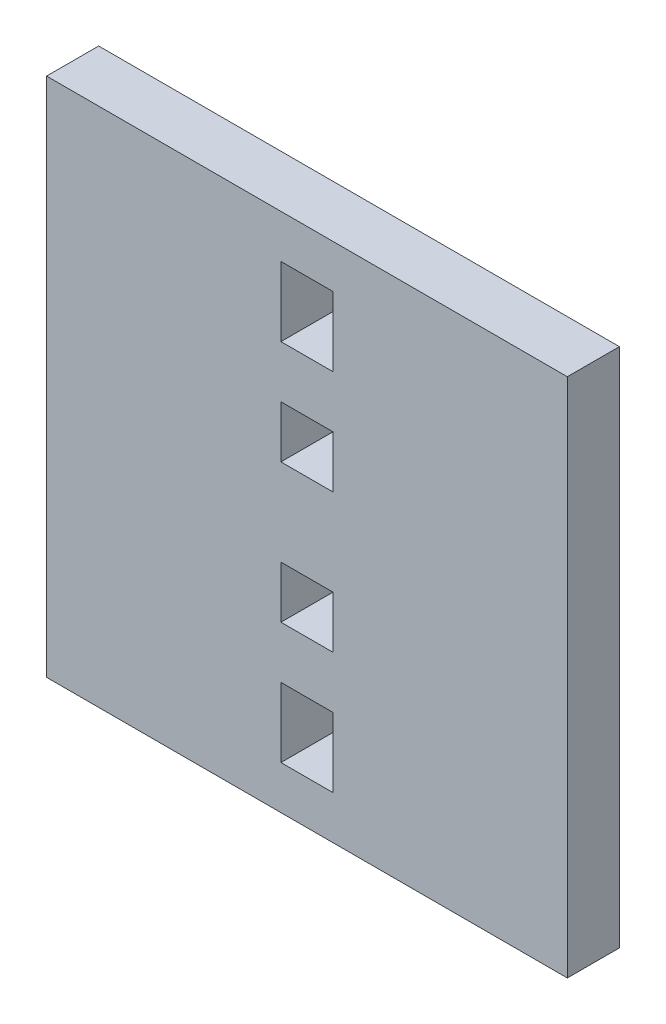
ISO-10303-21;
HEADER;
FILE_DESCRIPTION(('STEP AP214'),'2;1');
FILE_NAME('part.step','',(''),(''),'','','');
FILE_SCHEMA(('AUTOMOTIVE_DESIGN { 1 0 10303 214 1 1 1 1 }'));
ENDSEC;
DATA;
#1=APPLICATION_CONTEXT('core data for automotive mechanical design processes');
#2=APPLICATION_PROTOCOL_DEFINITION('international standard','automotive_design',2000,#1);
#3=PRODUCT_CONTEXT('',#1,'mechanical');
#4=PRODUCT('Part','Part','',(#3));
#5=PRODUCT_RELATED_PRODUCT_CATEGORY('part','',(#4));
#6=PRODUCT_DEFINITION_FORMATION('','',#4);
#7=PRODUCT_DEFINITION_CONTEXT('part definition',#1,'design');
#8=PRODUCT_DEFINITION('design','',#6,#7);
#9=PRODUCT_DEFINITION_SHAPE('','',#8);
#10=(LENGTH_UNIT() NAMED_UNIT(*) SI_UNIT(.MILLI.,.METRE.));
#11=(NAMED_UNIT(*) PLANE_ANGLE_UNIT() SI_UNIT($,.RADIAN.));
#12=(NAMED_UNIT(*) SI_UNIT($,.STERADIAN.) SOLID_ANGLE_UNIT());
#13=UNCERTAINTY_MEASURE_WITH_UNIT(LENGTH_MEASURE(1.E-05),#10,'distance_accuracy_value','');
#14=(GEOMETRIC_REPRESENTATION_CONTEXT(3) GLOBAL_UNCERTAINTY_ASSIGNED_CONTEXT((#13)) GLOBAL_UNIT_ASSIGNED_CONTEXT((#10,
#11,#12)) REPRESENTATION_CONTEXT('',''));
#15=CARTESIAN_POINT('',(0.,0.,0.));
#16=DIRECTION('',(0.,0.,1.));
#17=DIRECTION('',(1.,0.,0.));
#18=AXIS2_PLACEMENT_3D('',#15,#16,#17);
#19=CARTESIAN_POINT('',(0.,0.,6.));
#20=DIRECTION('',(0.,0.,1.));
#21=DIRECTION('',(1.,0.,0.));
#22=AXIS2_PLACEMENT_3D('',#19,#20,#21);
#23=PLANE('',#22);
#24=DIRECTION('',(0.,-1.,0.));
#25=VECTOR('',#24,1.);
#26=CARTESIAN_POINT('',(-30.,37.4757281553398,6.));
#27=LINE('',#26,#25);
#28=CARTESIAN_POINT('',(-30.,37.4757281553398,6.));
#29=VERTEX_POINT('',#28);
#30=CARTESIAN_POINT('',(-30.,-22.5242718446602,6.));
#31=VERTEX_POINT('',#30);
#32=EDGE_CURVE('E360',#29,#31,#27,.T.);
#33=ORIENTED_EDGE('',*,*,#32,.T.);
#34=DIRECTION('',(1.,0.,0.));
#35=VECTOR('',#34,1.);
#36=CARTESIAN_POINT('',(-30.,-22.5242718446602,6.));
#37=LINE('',#36,#35);
#38=CARTESIAN_POINT('',(30.,-22.5242718446602,6.));
#39=VERTEX_POINT('',#38);
#40=EDGE_CURVE('E364',#31,#39,#37,.T.);
#41=ORIENTED_EDGE('',*,*,#40,.T.);
#42=DIRECTION('',(0.,1.,0.));
#43=VECTOR('',#42,1.);
#44=CARTESIAN_POINT('',(30.,37.4757281553398,6.));
#45=LINE('',#44,#43);
#46=CARTESIAN_POINT('',(30.,37.4757281553398,6.));
#47=VERTEX_POINT('',#46);
#48=EDGE_CURVE('E368',#39,#47,#45,.T.);
#49=ORIENTED_EDGE('',*,*,#48,.T.);
#50=DIRECTION('',(-1.,0.,0.));
#51=VECTOR('',#50,1.);
#52=CARTESIAN_POINT('',(-30.,37.4757281553398,6.));
#53=LINE('',#52,#51);
#54=EDGE_CURVE('E371',#47,#29,#53,.T.);
#55=ORIENTED_EDGE('',*,*,#54,.T.);
#56=EDGE_LOOP('',(#33,#41,#49,#55));
#57=FACE_BOUND('',#56,.T.);
#58=DIRECTION('',(0.,1.,0.));
#59=VECTOR('',#58,1.);
#60=CARTESIAN_POINT('',(3.,24.4757281553398,6.));
#61=LINE('',#60,#59);
#62=CARTESIAN_POINT('',(3.,24.4757281553398,6.));
#63=VERTEX_POINT('',#62);
#64=CARTESIAN_POINT('',(3.,32.4757281553398,6.));
#65=VERTEX_POINT('',#64);
#66=EDGE_CURVE('E320',#63,#65,#61,.T.);
#67=ORIENTED_EDGE('',*,*,#66,.F.);
#68=DIRECTION('',(1.,0.,0.));
#69=VECTOR('',#68,1.);
#70=CARTESIAN_POINT('',(-3.,24.4757281553398,6.));
#71=LINE('',#70,#69);
#72=CARTESIAN_POINT('',(-3.,24.4757281553398,6.));
#73=VERTEX_POINT('',#72);
#74=EDGE_CURVE('E317',#73,#63,#71,.T.);
#75=ORIENTED_EDGE('',*,*,#74,.F.);
#76=DIRECTION('',(0.,-1.,0.));
#77=VECTOR('',#76,1.);
#78=CARTESIAN_POINT('',(-3.,24.4757281553398,6.));
#79=LINE('',#78,#77);
#80=CARTESIAN_POINT('',(-3.,32.4757281553398,6.));
#81=VERTEX_POINT('',#80);
#82=EDGE_CURVE('E328',#81,#73,#79,.T.);
#83=ORIENTED_EDGE('',*,*,#82,.F.);
#84=DIRECTION('',(-1.,0.,0.));
#85=VECTOR('',#84,1.);
#86=CARTESIAN_POINT('',(-3.,32.4757281553398,6.));
#87=LINE('',#86,#85);
#88=EDGE_CURVE('E324',#65,#81,#87,.T.);
#89=ORIENTED_EDGE('',*,*,#88,.F.);
#90=EDGE_LOOP('',(#67,#75,#83,#89));
#91=FACE_BOUND('',#90,.T.);
#92=DIRECTION('',(0.,-1.,0.));
#93=VECTOR('',#92,1.);
#94=CARTESIAN_POINT('',(-3.,-9.5242718446602,6.));
#95=LINE('',#94,#93);
#96=CARTESIAN_POINT('',(-3.,-9.5242718446602,6.));
#97=VERTEX_POINT('',#96);
#98=CARTESIAN_POINT('',(-3.,-17.5242718446602,6.));
#99=VERTEX_POINT('',#98);
#100=EDGE_CURVE('E277',#97,#99,#95,.T.);
#101=ORIENTED_EDGE('',*,*,#100,.F.);
#102=DIRECTION('',(-1.,0.,0.));
#103=VECTOR('',#102,1.);
#104=CARTESIAN_POINT('',(-3.,-9.5242718446602,6.));
#105=LINE('',#104,#103);
#106=CARTESIAN_POINT('',(3.,-9.5242718446602,6.));
#107=VERTEX_POINT('',#106);
#108=EDGE_CURVE('E274',#107,#97,#105,.T.);
#109=ORIENTED_EDGE('',*,*,#108,.F.);
#110=DIRECTION('',(0.,1.,0.));
#111=VECTOR('',#110,1.);
#112=CARTESIAN_POINT('',(3.,-9.5242718446602,6.));
#113=LINE('',#112,#111);
#114=CARTESIAN_POINT('',(3.,-17.5242718446602,6.));
#115=VERTEX_POINT('',#114);
#116=EDGE_CURVE('E285',#115,#107,#113,.T.);
#117=ORIENTED_EDGE('',*,*,#116,.F.);
#118=DIRECTION('',(1.,0.,0.));
#119=VECTOR('',#118,1.);
#120=CARTESIAN_POINT('',(-3.,-17.5242718446602,6.));
#121=LINE('',#120,#119);
#122=EDGE_CURVE('E281',#99,#115,#121,.T.);
#123=ORIENTED_EDGE('',*,*,#122,.F.);
#124=EDGE_LOOP('',(#101,#109,#117,#123));
#125=FACE_BOUND('',#124,.T.);
#126=DIRECTION('',(-1.,0.,0.));
#127=VECTOR('',#126,1.);
#128=CARTESIAN_POINT('',(3.,2.4757281553398,6.));
#129=LINE('',#128,#127);
#130=CARTESIAN_POINT('',(3.,2.4757281553398,6.));
#131=VERTEX_POINT('',#130);
#132=CARTESIAN_POINT('',(-3.,2.4757281553398,6.));
#133=VERTEX_POINT('',#132);
#134=EDGE_CURVE('E234',#131,#133,#129,.T.);
#135=ORIENTED_EDGE('',*,*,#134,.F.);
#136=DIRECTION('',(0.,1.,0.));
#137=VECTOR('',#136,1.);
#138=CARTESIAN_POINT('',(3.,2.4757281553398,6.));
#139=LINE('',#138,#137);
#140=CARTESIAN_POINT('',(3.,-3.5242718446602,6.));
#141=VERTEX_POINT('',#140);
#142=EDGE_CURVE('E231',#141,#131,#139,.T.);
#143=ORIENTED_EDGE('',*,*,#142,.F.);
#144=DIRECTION('',(1.,0.,0.));
#145=VECTOR('',#144,1.);
#146=CARTESIAN_POINT('',(3.,-3.5242718446602,6.));
#147=LINE('',#146,#145);
#148=CARTESIAN_POINT('',(-3.,-3.5242718446602,6.));
#149=VERTEX_POINT('',#148);
#150=EDGE_CURVE('E242',#149,#141,#147,.T.);
#151=ORIENTED_EDGE('',*,*,#150,.F.);
#152=DIRECTION('',(0.,-1.,0.));
#153=VECTOR('',#152,1.);
#154=CARTESIAN_POINT('',(-3.,2.4757281553398,6.));
#155=LINE('',#154,#153);
#156=EDGE_CURVE('E238',#133,#149,#155,.T.);
#157=ORIENTED_EDGE('',*,*,#156,.F.);
#158=EDGE_LOOP('',(#135,#143,#151,#157));
#159=FACE_BOUND('',#158,.T.);
#160=DIRECTION('',(-1.,0.,0.));
#161=VECTOR('',#160,1.);
#162=CARTESIAN_POINT('',(3.,18.4757281553398,6.));
#163=LINE('',#162,#161);
#164=CARTESIAN_POINT('',(3.,18.4757281553398,6.));
#165=VERTEX_POINT('',#164);
#166=CARTESIAN_POINT('',(-3.,18.4757281553398,6.));
#167=VERTEX_POINT('',#166);
#168=EDGE_CURVE('E192',#165,#167,#163,.T.);
#169=ORIENTED_EDGE('',*,*,#168,.F.);
#170=DIRECTION('',(0.,1.,0.));
#171=VECTOR('',#170,1.);
#172=CARTESIAN_POINT('',(3.,12.4757281553398,6.));
#173=LINE('',#172,#171);
#174=CARTESIAN_POINT('',(3.,12.4757281553398,6.));
#175=VERTEX_POINT('',#174);
#176=EDGE_CURVE('E183',#175,#165,#173,.T.);
#177=ORIENTED_EDGE('',*,*,#176,.F.);
#178=DIRECTION('',(1.,0.,0.));
#179=VECTOR('',#178,1.);
#180=CARTESIAN_POINT('',(3.,12.4757281553398,6.));
#181=LINE('',#180,#179);
#182=CARTESIAN_POINT('',(-3.,12.4757281553398,6.));
#183=VERTEX_POINT('',#182);
#184=EDGE_CURVE('E209',#183,#175,#181,.T.);
#185=ORIENTED_EDGE('',*,*,#184,.F.);
#186=DIRECTION('',(0.,-1.,0.));
#187=VECTOR('',#186,1.);
#188=CARTESIAN_POINT('',(-3.,12.4757281553398,6.));
#189=LINE('',#188,#187);
#190=EDGE_CURVE('E205',#167,#183,#189,.T.);
#191=ORIENTED_EDGE('',*,*,#190,.F.);
#192=EDGE_LOOP('',(#169,#177,#185,#191));
#193=FACE_BOUND('',#192,.T.);
#194=ADVANCED_FACE('F45',(#57,#91,#125,#159,#193),#23,.T.);
#195=CARTESIAN_POINT('',(0.,0.,0.));
#196=DIRECTION('',(0.,0.,1.));
#197=DIRECTION('',(1.,0.,0.));
#198=AXIS2_PLACEMENT_3D('',#195,#196,#197);
#199=PLANE('',#198);
#200=DIRECTION('',(0.,1.,0.));
#201=VECTOR('',#200,1.);
#202=CARTESIAN_POINT('',(3.,2.4757281553398,0.));
#203=LINE('',#202,#201);
#204=CARTESIAN_POINT('',(3.,-3.5242718446602,0.));
#205=VERTEX_POINT('',#204);
#206=CARTESIAN_POINT('',(3.,2.4757281553398,0.));
#207=VERTEX_POINT('',#206);
#208=EDGE_CURVE('E201',#205,#207,#203,.T.);
#209=ORIENTED_EDGE('',*,*,#208,.T.);
#210=DIRECTION('',(-1.,0.,0.));
#211=VECTOR('',#210,1.);
#212=CARTESIAN_POINT('',(3.,2.4757281553398,0.));
#213=LINE('',#212,#211);
#214=CARTESIAN_POINT('',(-3.,2.4757281553398,0.));
#215=VERTEX_POINT('',#214);
#216=EDGE_CURVE('E249',#207,#215,#213,.T.);
#217=ORIENTED_EDGE('',*,*,#216,.T.);
#218=DIRECTION('',(0.,-1.,0.));
#219=VECTOR('',#218,1.);
#220=CARTESIAN_POINT('',(-3.,2.4757281553398,0.));
#221=LINE('',#220,#219);
#222=CARTESIAN_POINT('',(-3.,-3.5242718446602,0.));
#223=VERTEX_POINT('',#222);
#224=EDGE_CURVE('E253',#215,#223,#221,.T.);
#225=ORIENTED_EDGE('',*,*,#224,.T.);
#226=DIRECTION('',(1.,0.,0.));
#227=VECTOR('',#226,1.);
#228=CARTESIAN_POINT('',(3.,-3.5242718446602,0.));
#229=LINE('',#228,#227);
#230=EDGE_CURVE('E235',#223,#205,#229,.T.);
#231=ORIENTED_EDGE('',*,*,#230,.T.);
#232=EDGE_LOOP('',(#209,#217,#225,#231));
#233=FACE_BOUND('',#232,.T.);
#234=DIRECTION('',(1.,0.,0.));
#235=VECTOR('',#234,1.);
#236=CARTESIAN_POINT('',(-3.,24.4757281553398,0.));
#237=LINE('',#236,#235);
#238=CARTESIAN_POINT('',(-3.,24.4757281553398,0.));
#239=VERTEX_POINT('',#238);
#240=CARTESIAN_POINT('',(3.,24.4757281553398,0.));
#241=VERTEX_POINT('',#240);
#242=EDGE_CURVE('E316',#239,#241,#237,.T.);
#243=ORIENTED_EDGE('',*,*,#242,.T.);
#244=DIRECTION('',(0.,1.,0.));
#245=VECTOR('',#244,1.);
#246=CARTESIAN_POINT('',(3.,24.4757281553398,0.));
#247=LINE('',#246,#245);
#248=CARTESIAN_POINT('',(3.,32.4757281553398,0.));
#249=VERTEX_POINT('',#248);
#250=EDGE_CURVE('E335',#241,#249,#247,.T.);
#251=ORIENTED_EDGE('',*,*,#250,.T.);
#252=DIRECTION('',(-1.,0.,0.));
#253=VECTOR('',#252,1.);
#254=CARTESIAN_POINT('',(-3.,32.4757281553398,0.));
#255=LINE('',#254,#253);
#256=CARTESIAN_POINT('',(-3.,32.4757281553398,0.));
#257=VERTEX_POINT('',#256);
#258=EDGE_CURVE('E339',#249,#257,#255,.T.);
#259=ORIENTED_EDGE('',*,*,#258,.T.);
#260=DIRECTION('',(0.,-1.,0.));
#261=VECTOR('',#260,1.);
#262=CARTESIAN_POINT('',(-3.,24.4757281553398,0.));
#263=LINE('',#262,#261);
#264=EDGE_CURVE('E321',#257,#239,#263,.T.);
#265=ORIENTED_EDGE('',*,*,#264,.T.);
#266=EDGE_LOOP('',(#243,#251,#259,#265));
#267=FACE_BOUND('',#266,.T.);
#268=DIRECTION('',(0.,-1.,0.));
#269=VECTOR('',#268,1.);
#270=CARTESIAN_POINT('',(-30.,37.4757281553398,0.));
#271=LINE('',#270,#269);
#272=CARTESIAN_POINT('',(-30.,37.4757281553398,0.));
#273=VERTEX_POINT('',#272);
#274=CARTESIAN_POINT('',(-30.,-22.5242718446602,0.));
#275=VERTEX_POINT('',#274);
#276=EDGE_CURVE('E359',#273,#275,#271,.T.);
#277=ORIENTED_EDGE('',*,*,#276,.F.);
#278=DIRECTION('',(-1.,0.,0.));
#279=VECTOR('',#278,1.);
#280=CARTESIAN_POINT('',(-30.,37.4757281553398,0.));
#281=LINE('',#280,#279);
#282=CARTESIAN_POINT('',(30.,37.4757281553398,0.));
#283=VERTEX_POINT('',#282);
#284=EDGE_CURVE('E365',#283,#273,#281,.T.);
#285=ORIENTED_EDGE('',*,*,#284,.F.);
#286=DIRECTION('',(0.,1.,0.));
#287=VECTOR('',#286,1.);
#288=CARTESIAN_POINT('',(30.,37.4757281553398,0.));
#289=LINE('',#288,#287);
#290=CARTESIAN_POINT('',(30.,-22.5242718446602,0.));
#291=VERTEX_POINT('',#290);
#292=EDGE_CURVE('E381',#291,#283,#289,.T.);
#293=ORIENTED_EDGE('',*,*,#292,.F.);
#294=DIRECTION('',(1.,0.,0.));
#295=VECTOR('',#294,1.);
#296=CARTESIAN_POINT('',(-30.,-22.5242718446602,0.));
#297=LINE('',#296,#295);
#298=EDGE_CURVE('E378',#275,#291,#297,.T.);
#299=ORIENTED_EDGE('',*,*,#298,.F.);
#300=EDGE_LOOP('',(#277,#285,#293,#299));
#301=FACE_BOUND('',#300,.T.);
#302=DIRECTION('',(-1.,0.,0.));
#303=VECTOR('',#302,1.);
#304=CARTESIAN_POINT('',(-3.,-9.5242718446602,0.));
#305=LINE('',#304,#303);
#306=CARTESIAN_POINT('',(3.,-9.5242718446602,0.));
#307=VERTEX_POINT('',#306);
#308=CARTESIAN_POINT('',(-3.,-9.5242718446602,0.));
#309=VERTEX_POINT('',#308);
#310=EDGE_CURVE('E273',#307,#309,#305,.T.);
#311=ORIENTED_EDGE('',*,*,#310,.T.);
#312=DIRECTION('',(0.,-1.,0.));
#313=VECTOR('',#312,1.);
#314=CARTESIAN_POINT('',(-3.,-9.5242718446602,0.));
#315=LINE('',#314,#313);
#316=CARTESIAN_POINT('',(-3.,-17.5242718446602,0.));
#317=VERTEX_POINT('',#316);
#318=EDGE_CURVE('E292',#309,#317,#315,.T.);
#319=ORIENTED_EDGE('',*,*,#318,.T.);
#320=DIRECTION('',(1.,0.,0.));
#321=VECTOR('',#320,1.);
#322=CARTESIAN_POINT('',(-3.,-17.5242718446602,0.));
#323=LINE('',#322,#321);
#324=CARTESIAN_POINT('',(3.,-17.5242718446602,0.));
#325=VERTEX_POINT('',#324);
#326=EDGE_CURVE('E296',#317,#325,#323,.T.);
#327=ORIENTED_EDGE('',*,*,#326,.T.);
#328=DIRECTION('',(0.,1.,0.));
#329=VECTOR('',#328,1.);
#330=CARTESIAN_POINT('',(3.,-9.5242718446602,0.));
#331=LINE('',#330,#329);
#332=EDGE_CURVE('E278',#325,#307,#331,.T.);
#333=ORIENTED_EDGE('',*,*,#332,.T.);
#334=EDGE_LOOP('',(#311,#319,#327,#333));
#335=FACE_BOUND('',#334,.T.);
#336=DIRECTION('',(0.,1.,0.));
#337=VECTOR('',#336,1.);
#338=CARTESIAN_POINT('',(3.,12.4757281553398,0.));
#339=LINE('',#338,#337);
#340=CARTESIAN_POINT('',(3.,12.4757281553398,0.));
#341=VERTEX_POINT('',#340);
#342=CARTESIAN_POINT('',(3.,18.4757281553398,0.));
#343=VERTEX_POINT('',#342);
#344=EDGE_CURVE('E69',#341,#343,#339,.T.);
#345=ORIENTED_EDGE('',*,*,#344,.T.);
#346=DIRECTION('',(-1.,0.,0.));
#347=VECTOR('',#346,1.);
#348=CARTESIAN_POINT('',(3.,18.4757281553398,0.));
#349=LINE('',#348,#347);
#350=CARTESIAN_POINT('',(-3.,18.4757281553398,0.));
#351=VERTEX_POINT('',#350);
#352=EDGE_CURVE('E199',#343,#351,#349,.T.);
#353=ORIENTED_EDGE('',*,*,#352,.T.);
#354=DIRECTION('',(0.,-1.,0.));
#355=VECTOR('',#354,1.);
#356=CARTESIAN_POINT('',(-3.,12.4757281553398,0.));
#357=LINE('',#356,#355);
#358=CARTESIAN_POINT('',(-3.,12.4757281553398,0.));
#359=VERTEX_POINT('',#358);
#360=EDGE_CURVE('E218',#351,#359,#357,.T.);
#361=ORIENTED_EDGE('',*,*,#360,.T.);
#362=DIRECTION('',(1.,0.,0.));
#363=VECTOR('',#362,1.);
#364=CARTESIAN_POINT('',(3.,12.4757281553398,0.));
#365=LINE('',#364,#363);
#366=EDGE_CURVE('E193',#359,#341,#365,.T.);
#367=ORIENTED_EDGE('',*,*,#366,.T.);
#368=EDGE_LOOP('',(#345,#353,#361,#367));
#369=FACE_BOUND('',#368,.T.);
#370=ADVANCED_FACE('F404',(#233,#267,#301,#335,#369),#199,.F.);
#371=CARTESIAN_POINT('',(-30.,37.4757281553398,6.));
#372=DIRECTION('',(1.,0.,0.));
#373=DIRECTION('',(0.,1.,0.));
#374=AXIS2_PLACEMENT_3D('',#371,#372,#373);
#375=PLANE('',#374);
#376=ORIENTED_EDGE('',*,*,#276,.T.);
#377=DIRECTION('',(0.,0.,-1.));
#378=VECTOR('',#377,1.);
#379=CARTESIAN_POINT('',(-30.,-22.5242718446602,6.));
#380=LINE('',#379,#378);
#381=EDGE_CURVE('E11',#31,#275,#380,.T.);
#382=ORIENTED_EDGE('',*,*,#381,.F.);
#383=ORIENTED_EDGE('',*,*,#32,.F.);
#384=DIRECTION('',(0.,0.,-1.));
#385=VECTOR('',#384,1.);
#386=CARTESIAN_POINT('',(-30.,37.4757281553398,6.));
#387=LINE('',#386,#385);
#388=EDGE_CURVE('E374',#29,#273,#387,.T.);
#389=ORIENTED_EDGE('',*,*,#388,.T.);
#390=EDGE_LOOP('',(#376,#382,#383,#389));
#391=FACE_BOUND('',#390,.T.);
#392=ADVANCED_FACE('F47',(#391),#375,.F.);
#393=CARTESIAN_POINT('',(-30.,-22.5242718446602,6.));
#394=DIRECTION('',(0.,1.,0.));
#395=DIRECTION('',(0.,0.,1.));
#396=AXIS2_PLACEMENT_3D('',#393,#394,#395);
#397=PLANE('',#396);
#398=ORIENTED_EDGE('',*,*,#298,.T.);
#399=DIRECTION('',(0.,0.,-1.));
#400=VECTOR('',#399,1.);
#401=CARTESIAN_POINT('',(30.,-22.5242718446602,6.));
#402=LINE('',#401,#400);
#403=EDGE_CURVE('E54',#39,#291,#402,.T.);
#404=ORIENTED_EDGE('',*,*,#403,.F.);
#405=ORIENTED_EDGE('',*,*,#40,.F.);
#406=ORIENTED_EDGE('',*,*,#381,.T.);
#407=EDGE_LOOP('',(#398,#404,#405,#406));
#408=FACE_BOUND('',#407,.T.);
#409=ADVANCED_FACE('F415',(#408),#397,.F.);
#410=CARTESIAN_POINT('',(30.,37.4757281553398,6.));
#411=DIRECTION('',(-1.,0.,0.));
#412=DIRECTION('',(0.,-1.,0.));
#413=AXIS2_PLACEMENT_3D('',#410,#411,#412);
#414=PLANE('',#413);
#415=ORIENTED_EDGE('',*,*,#292,.T.);
#416=DIRECTION('',(0.,0.,-1.));
#417=VECTOR('',#416,1.);
#418=CARTESIAN_POINT('',(30.,37.4757281553398,6.));
#419=LINE('',#418,#417);
#420=EDGE_CURVE('E389',#47,#283,#419,.T.);
#421=ORIENTED_EDGE('',*,*,#420,.F.);
#422=ORIENTED_EDGE('',*,*,#48,.F.);
#423=ORIENTED_EDGE('',*,*,#403,.T.);
#424=EDGE_LOOP('',(#415,#421,#422,#423));
#425=FACE_BOUND('',#424,.T.);
#426=ADVANCED_FACE('F398',(#425),#414,.F.);
#427=CARTESIAN_POINT('',(-30.,37.4757281553398,6.));
#428=DIRECTION('',(0.,-1.,0.));
#429=DIRECTION('',(0.,0.,-1.));
#430=AXIS2_PLACEMENT_3D('',#427,#428,#429);
#431=PLANE('',#430);
#432=ORIENTED_EDGE('',*,*,#284,.T.);
#433=ORIENTED_EDGE('',*,*,#388,.F.);
#434=ORIENTED_EDGE('',*,*,#54,.F.);
#435=ORIENTED_EDGE('',*,*,#420,.T.);
#436=EDGE_LOOP('',(#432,#433,#434,#435));
#437=FACE_BOUND('',#436,.T.);
#438=ADVANCED_FACE('F408',(#437),#431,.F.);
#439=CARTESIAN_POINT('',(-3.,24.4757281553398,6.));
#440=DIRECTION('',(0.,1.,0.));
#441=DIRECTION('',(0.,0.,1.));
#442=AXIS2_PLACEMENT_3D('',#439,#440,#441);
#443=PLANE('',#442);
#444=ORIENTED_EDGE('',*,*,#242,.F.);
#445=DIRECTION('',(0.,0.,-1.));
#446=VECTOR('',#445,1.);
#447=CARTESIAN_POINT('',(-3.,24.4757281553398,6.));
#448=LINE('',#447,#446);
#449=EDGE_CURVE('E331',#73,#239,#448,.T.);
#450=ORIENTED_EDGE('',*,*,#449,.F.);
#451=ORIENTED_EDGE('',*,*,#74,.T.);
#452=DIRECTION('',(0.,0.,-1.));
#453=VECTOR('',#452,1.);
#454=CARTESIAN_POINT('',(3.,24.4757281553398,6.));
#455=LINE('',#454,#453);
#456=EDGE_CURVE('E355',#63,#241,#455,.T.);
#457=ORIENTED_EDGE('',*,*,#456,.T.);
#458=EDGE_LOOP('',(#444,#450,#451,#457));
#459=FACE_BOUND('',#458,.T.);
#460=ADVANCED_FACE('F430',(#459),#443,.T.);
#461=CARTESIAN_POINT('',(3.,24.4757281553398,6.));
#462=DIRECTION('',(-1.,0.,0.));
#463=DIRECTION('',(0.,-1.,0.));
#464=AXIS2_PLACEMENT_3D('',#461,#462,#463);
#465=PLANE('',#464);
#466=ORIENTED_EDGE('',*,*,#250,.F.);
#467=ORIENTED_EDGE('',*,*,#456,.F.);
#468=ORIENTED_EDGE('',*,*,#66,.T.);
#469=DIRECTION('',(0.,0.,-1.));
#470=VECTOR('',#469,1.);
#471=CARTESIAN_POINT('',(3.,32.4757281553398,6.));
#472=LINE('',#471,#470);
#473=EDGE_CURVE('E352',#65,#249,#472,.T.);
#474=ORIENTED_EDGE('',*,*,#473,.T.);
#475=EDGE_LOOP('',(#466,#467,#468,#474));
#476=FACE_BOUND('',#475,.T.);
#477=ADVANCED_FACE('F437',(#476),#465,.T.);
#478=CARTESIAN_POINT('',(-3.,32.4757281553398,6.));
#479=DIRECTION('',(0.,-1.,0.));
#480=DIRECTION('',(0.,0.,-1.));
#481=AXIS2_PLACEMENT_3D('',#478,#479,#480);
#482=PLANE('',#481);
#483=ORIENTED_EDGE('',*,*,#258,.F.);
#484=ORIENTED_EDGE('',*,*,#473,.F.);
#485=ORIENTED_EDGE('',*,*,#88,.T.);
#486=DIRECTION('',(0.,0.,-1.));
#487=VECTOR('',#486,1.);
#488=CARTESIAN_POINT('',(-3.,32.4757281553398,6.));
#489=LINE('',#488,#487);
#490=EDGE_CURVE('E349',#81,#257,#489,.T.);
#491=ORIENTED_EDGE('',*,*,#490,.T.);
#492=EDGE_LOOP('',(#483,#484,#485,#491));
#493=FACE_BOUND('',#492,.T.);
#494=ADVANCED_FACE('F442',(#493),#482,.T.);
#495=CARTESIAN_POINT('',(-3.,24.4757281553398,6.));
#496=DIRECTION('',(1.,0.,0.));
#497=DIRECTION('',(0.,1.,0.));
#498=AXIS2_PLACEMENT_3D('',#495,#496,#497);
#499=PLANE('',#498);
#500=ORIENTED_EDGE('',*,*,#264,.F.);
#501=ORIENTED_EDGE('',*,*,#490,.F.);
#502=ORIENTED_EDGE('',*,*,#82,.T.);
#503=ORIENTED_EDGE('',*,*,#449,.T.);
#504=EDGE_LOOP('',(#500,#501,#502,#503));
#505=FACE_BOUND('',#504,.T.);
#506=ADVANCED_FACE('F450',(#505),#499,.T.);
#507=CARTESIAN_POINT('',(-3.,-9.5242718446602,6.));
#508=DIRECTION('',(0.,-1.,0.));
#509=DIRECTION('',(0.,0.,-1.));
#510=AXIS2_PLACEMENT_3D('',#507,#508,#509);
#511=PLANE('',#510);
#512=ORIENTED_EDGE('',*,*,#310,.F.);
#513=DIRECTION('',(0.,0.,-1.));
#514=VECTOR('',#513,1.);
#515=CARTESIAN_POINT('',(3.,-9.5242718446602,6.));
#516=LINE('',#515,#514);
#517=EDGE_CURVE('E288',#107,#307,#516,.T.);
#518=ORIENTED_EDGE('',*,*,#517,.F.);
#519=ORIENTED_EDGE('',*,*,#108,.T.);
#520=DIRECTION('',(0.,0.,-1.));
#521=VECTOR('',#520,1.);
#522=CARTESIAN_POINT('',(-3.,-9.5242718446602,6.));
#523=LINE('',#522,#521);
#524=EDGE_CURVE('E312',#97,#309,#523,.T.);
#525=ORIENTED_EDGE('',*,*,#524,.T.);
#526=EDGE_LOOP('',(#512,#518,#519,#525));
#527=FACE_BOUND('',#526,.T.);
#528=ADVANCED_FACE('F504',(#527),#511,.T.);
#529=CARTESIAN_POINT('',(-3.,-9.5242718446602,6.));
#530=DIRECTION('',(1.,0.,0.));
#531=DIRECTION('',(0.,1.,0.));
#532=AXIS2_PLACEMENT_3D('',#529,#530,#531);
#533=PLANE('',#532);
#534=ORIENTED_EDGE('',*,*,#318,.F.);
#535=ORIENTED_EDGE('',*,*,#524,.F.);
#536=ORIENTED_EDGE('',*,*,#100,.T.);
#537=DIRECTION('',(0.,0.,-1.));
#538=VECTOR('',#537,1.);
#539=CARTESIAN_POINT('',(-3.,-17.5242718446602,6.));
#540=LINE('',#539,#538);
#541=EDGE_CURVE('E309',#99,#317,#540,.T.);
#542=ORIENTED_EDGE('',*,*,#541,.T.);
#543=EDGE_LOOP('',(#534,#535,#536,#542));
#544=FACE_BOUND('',#543,.T.);
#545=ADVANCED_FACE('F500',(#544),#533,.T.);
#546=CARTESIAN_POINT('',(-3.,-17.5242718446602,6.));
#547=DIRECTION('',(0.,1.,0.));
#548=DIRECTION('',(0.,0.,1.));
#549=AXIS2_PLACEMENT_3D('',#546,#547,#548);
#550=PLANE('',#549);
#551=ORIENTED_EDGE('',*,*,#326,.F.);
#552=ORIENTED_EDGE('',*,*,#541,.F.);
#553=ORIENTED_EDGE('',*,*,#122,.T.);
#554=DIRECTION('',(0.,0.,-1.));
#555=VECTOR('',#554,1.);
#556=CARTESIAN_POINT('',(3.,-17.5242718446602,6.));
#557=LINE('',#556,#555);
#558=EDGE_CURVE('E306',#115,#325,#557,.T.);
#559=ORIENTED_EDGE('',*,*,#558,.T.);
#560=EDGE_LOOP('',(#551,#552,#553,#559));
#561=FACE_BOUND('',#560,.T.);
#562=ADVANCED_FACE('F496',(#561),#550,.T.);
#563=CARTESIAN_POINT('',(3.,-9.5242718446602,6.));
#564=DIRECTION('',(-1.,0.,0.));
#565=DIRECTION('',(0.,-1.,0.));
#566=AXIS2_PLACEMENT_3D('',#563,#564,#565);
#567=PLANE('',#566);
#568=ORIENTED_EDGE('',*,*,#332,.F.);
#569=ORIENTED_EDGE('',*,*,#558,.F.);
#570=ORIENTED_EDGE('',*,*,#116,.T.);
#571=ORIENTED_EDGE('',*,*,#517,.T.);
#572=EDGE_LOOP('',(#568,#569,#570,#571));
#573=FACE_BOUND('',#572,.T.);
#574=ADVANCED_FACE('F493',(#573),#567,.T.);
#575=CARTESIAN_POINT('',(3.,2.4757281553398,6.));
#576=DIRECTION('',(-1.,0.,0.));
#577=DIRECTION('',(0.,-1.,0.));
#578=AXIS2_PLACEMENT_3D('',#575,#576,#577);
#579=PLANE('',#578);
#580=ORIENTED_EDGE('',*,*,#208,.F.);
#581=DIRECTION('',(0.,0.,-1.));
#582=VECTOR('',#581,1.);
#583=CARTESIAN_POINT('',(3.,-3.5242718446602,6.));
#584=LINE('',#583,#582);
#585=EDGE_CURVE('E245',#141,#205,#584,.T.);
#586=ORIENTED_EDGE('',*,*,#585,.F.);
#587=ORIENTED_EDGE('',*,*,#142,.T.);
#588=DIRECTION('',(0.,0.,-1.));
#589=VECTOR('',#588,1.);
#590=CARTESIAN_POINT('',(3.,2.4757281553398,6.));
#591=LINE('',#590,#589);
#592=EDGE_CURVE('E269',#131,#207,#591,.T.);
#593=ORIENTED_EDGE('',*,*,#592,.T.);
#594=EDGE_LOOP('',(#580,#586,#587,#593));
#595=FACE_BOUND('',#594,.T.);
#596=ADVANCED_FACE('F475',(#595),#579,.T.);
#597=CARTESIAN_POINT('',(3.,2.4757281553398,6.));
#598=DIRECTION('',(0.,-1.,0.));
#599=DIRECTION('',(0.,0.,-1.));
#600=AXIS2_PLACEMENT_3D('',#597,#598,#599);
#601=PLANE('',#600);
#602=ORIENTED_EDGE('',*,*,#216,.F.);
#603=ORIENTED_EDGE('',*,*,#592,.F.);
#604=ORIENTED_EDGE('',*,*,#134,.T.);
#605=DIRECTION('',(0.,0.,-1.));
#606=VECTOR('',#605,1.);
#607=CARTESIAN_POINT('',(-3.,2.4757281553398,6.));
#608=LINE('',#607,#606);
#609=EDGE_CURVE('E266',#133,#215,#608,.T.);
#610=ORIENTED_EDGE('',*,*,#609,.T.);
#611=EDGE_LOOP('',(#602,#603,#604,#610));
#612=FACE_BOUND('',#611,.T.);
#613=ADVANCED_FACE('F469',(#612),#601,.T.);
#614=CARTESIAN_POINT('',(-3.,2.4757281553398,6.));
#615=DIRECTION('',(1.,0.,0.));
#616=DIRECTION('',(0.,1.,0.));
#617=AXIS2_PLACEMENT_3D('',#614,#615,#616);
#618=PLANE('',#617);
#619=ORIENTED_EDGE('',*,*,#224,.F.);
#620=ORIENTED_EDGE('',*,*,#609,.F.);
#621=ORIENTED_EDGE('',*,*,#156,.T.);
#622=DIRECTION('',(0.,0.,-1.));
#623=VECTOR('',#622,1.);
#624=CARTESIAN_POINT('',(-3.,-3.5242718446602,6.));
#625=LINE('',#624,#623);
#626=EDGE_CURVE('E263',#149,#223,#625,.T.);
#627=ORIENTED_EDGE('',*,*,#626,.T.);
#628=EDGE_LOOP('',(#619,#620,#621,#627));
#629=FACE_BOUND('',#628,.T.);
#630=ADVANCED_FACE('F472',(#629),#618,.T.);
#631=CARTESIAN_POINT('',(3.,-3.5242718446602,6.));
#632=DIRECTION('',(0.,1.,0.));
#633=DIRECTION('',(-1.,0.,0.));
#634=AXIS2_PLACEMENT_3D('',#631,#632,#633);
#635=PLANE('',#634);
#636=ORIENTED_EDGE('',*,*,#230,.F.);
#637=ORIENTED_EDGE('',*,*,#626,.F.);
#638=ORIENTED_EDGE('',*,*,#150,.T.);
#639=ORIENTED_EDGE('',*,*,#585,.T.);
#640=EDGE_LOOP('',(#636,#637,#638,#639));
#641=FACE_BOUND('',#640,.T.);
#642=ADVANCED_FACE('F478',(#641),#635,.T.);
#643=CARTESIAN_POINT('',(3.,12.4757281553398,6.));
#644=DIRECTION('',(-1.,0.,0.));
#645=DIRECTION('',(0.,-1.,0.));
#646=AXIS2_PLACEMENT_3D('',#643,#644,#645);
#647=PLANE('',#646);
#648=ORIENTED_EDGE('',*,*,#344,.F.);
#649=DIRECTION('',(0.,0.,-1.));
#650=VECTOR('',#649,1.);
#651=CARTESIAN_POINT('',(3.,12.4757281553398,6.));
#652=LINE('',#651,#650);
#653=EDGE_CURVE('E187',#175,#341,#652,.T.);
#654=ORIENTED_EDGE('',*,*,#653,.F.);
#655=ORIENTED_EDGE('',*,*,#176,.T.);
#656=DIRECTION('',(0.,0.,-1.));
#657=VECTOR('',#656,1.);
#658=CARTESIAN_POINT('',(3.,18.4757281553398,6.));
#659=LINE('',#658,#657);
#660=EDGE_CURVE('E186',#165,#343,#659,.T.);
#661=ORIENTED_EDGE('',*,*,#660,.T.);
#662=EDGE_LOOP('',(#648,#654,#655,#661));
#663=FACE_BOUND('',#662,.T.);
#664=ADVANCED_FACE('F185',(#663),#647,.T.);
#665=CARTESIAN_POINT('',(3.,18.4757281553398,6.));
#666=DIRECTION('',(0.,-1.,0.));
#667=DIRECTION('',(0.,0.,-1.));
#668=AXIS2_PLACEMENT_3D('',#665,#666,#667);
#669=PLANE('',#668);
#670=ORIENTED_EDGE('',*,*,#352,.F.);
#671=ORIENTED_EDGE('',*,*,#660,.F.);
#672=ORIENTED_EDGE('',*,*,#168,.T.);
#673=DIRECTION('',(0.,0.,-1.));
#674=VECTOR('',#673,1.);
#675=CARTESIAN_POINT('',(-3.,18.4757281553398,6.));
#676=LINE('',#675,#674);
#677=EDGE_CURVE('E202',#167,#351,#676,.T.);
#678=ORIENTED_EDGE('',*,*,#677,.T.);
#679=EDGE_LOOP('',(#670,#671,#672,#678));
#680=FACE_BOUND('',#679,.T.);
#681=ADVANCED_FACE('F196',(#680),#669,.T.);
#682=CARTESIAN_POINT('',(-3.,12.4757281553398,6.));
#683=DIRECTION('',(1.,0.,0.));
#684=DIRECTION('',(0.,1.,0.));
#685=AXIS2_PLACEMENT_3D('',#682,#683,#684);
#686=PLANE('',#685);
#687=ORIENTED_EDGE('',*,*,#360,.F.);
#688=ORIENTED_EDGE('',*,*,#677,.F.);
#689=ORIENTED_EDGE('',*,*,#190,.T.);
#690=DIRECTION('',(0.,0.,-1.));
#691=VECTOR('',#690,1.);
#692=CARTESIAN_POINT('',(-3.,12.4757281553398,6.));
#693=LINE('',#692,#691);
#694=EDGE_CURVE('E61',#183,#359,#693,.T.);
#695=ORIENTED_EDGE('',*,*,#694,.T.);
#696=EDGE_LOOP('',(#687,#688,#689,#695));
#697=FACE_BOUND('',#696,.T.);
#698=ADVANCED_FACE('F576',(#697),#686,.T.);
#699=CARTESIAN_POINT('',(3.,12.4757281553398,6.));
#700=DIRECTION('',(0.,1.,0.));
#701=DIRECTION('',(0.,0.,1.));
#702=AXIS2_PLACEMENT_3D('',#699,#700,#701);
#703=PLANE('',#702);
#704=ORIENTED_EDGE('',*,*,#366,.F.);
#705=ORIENTED_EDGE('',*,*,#694,.F.);
#706=ORIENTED_EDGE('',*,*,#184,.T.);
#707=ORIENTED_EDGE('',*,*,#653,.T.);
#708=EDGE_LOOP('',(#704,#705,#706,#707));
#709=FACE_BOUND('',#708,.T.);
#710=ADVANCED_FACE('F584',(#709),#703,.T.);
#711=CLOSED_SHELL('',(#194,#370,#392,#409,#426,#438,#460,#477,#494,#506,#528,#545,#562,#574,
#596,#613,#630,#642,#664,#681,#698,#710));
#712=MANIFOLD_SOLID_BREP('B2',#711);
#713=ADVANCED_BREP_SHAPE_REPRESENTATION('',(#18,#712),#14);
#714=SHAPE_DEFINITION_REPRESENTATION(#9,#713);
ENDSEC;
END-ISO-10303-21;
